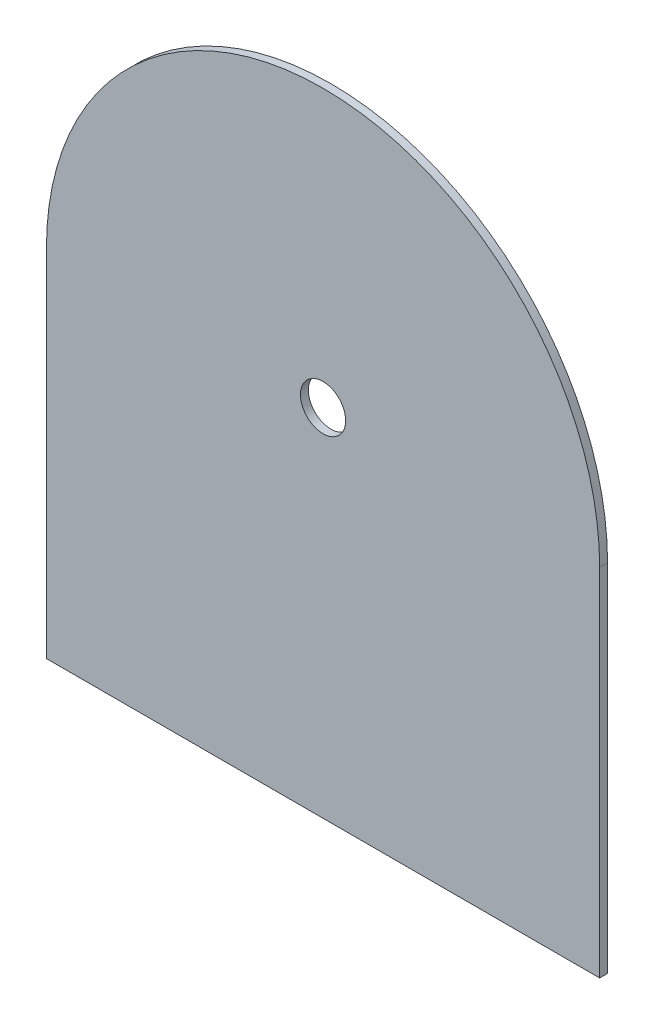
ISO-10303-21;
HEADER;
FILE_DESCRIPTION(('STEP AP214'),'2;1');
FILE_NAME('part.step','',(''),(''),'','','');
FILE_SCHEMA(('AUTOMOTIVE_DESIGN { 1 0 10303 214 1 1 1 1 }'));
ENDSEC;
DATA;
#1=APPLICATION_CONTEXT('core data for automotive mechanical design processes');
#2=APPLICATION_PROTOCOL_DEFINITION('international standard','automotive_design',2000,#1);
#3=PRODUCT_CONTEXT('',#1,'mechanical');
#4=PRODUCT('Part','Part','',(#3));
#5=PRODUCT_RELATED_PRODUCT_CATEGORY('part','',(#4));
#6=PRODUCT_DEFINITION_FORMATION('','',#4);
#7=PRODUCT_DEFINITION_CONTEXT('part definition',#1,'design');
#8=PRODUCT_DEFINITION('design','',#6,#7);
#9=PRODUCT_DEFINITION_SHAPE('','',#8);
#10=(LENGTH_UNIT() NAMED_UNIT(*) SI_UNIT(.MILLI.,.METRE.));
#11=(NAMED_UNIT(*) PLANE_ANGLE_UNIT() SI_UNIT($,.RADIAN.));
#12=(NAMED_UNIT(*) SI_UNIT($,.STERADIAN.) SOLID_ANGLE_UNIT());
#13=UNCERTAINTY_MEASURE_WITH_UNIT(LENGTH_MEASURE(1.E-05),#10,'distance_accuracy_value','');
#14=(GEOMETRIC_REPRESENTATION_CONTEXT(3) GLOBAL_UNCERTAINTY_ASSIGNED_CONTEXT((#13)) GLOBAL_UNIT_ASSIGNED_CONTEXT((#10,
#11,#12)) REPRESENTATION_CONTEXT('',''));
#15=CARTESIAN_POINT('',(0.,0.,0.));
#16=DIRECTION('',(0.,0.,1.));
#17=DIRECTION('',(1.,0.,0.));
#18=AXIS2_PLACEMENT_3D('',#15,#16,#17);
#19=CARTESIAN_POINT('',(-175.,0.,5.));
#20=DIRECTION('',(0.,1.,0.));
#21=DIRECTION('',(-1.,0.,0.));
#22=AXIS2_PLACEMENT_3D('',#19,#20,#21);
#23=PLANE('',#22);
#24=DIRECTION('',(1.,0.,0.));
#25=VECTOR('',#24,1.);
#26=CARTESIAN_POINT('',(-175.,0.,0.));
#27=LINE('',#26,#25);
#28=CARTESIAN_POINT('',(-175.,0.,0.));
#29=VERTEX_POINT('',#28);
#30=CARTESIAN_POINT('',(175.,0.,0.));
#31=VERTEX_POINT('',#30);
#32=EDGE_CURVE('E99',#29,#31,#27,.T.);
#33=ORIENTED_EDGE('',*,*,#32,.T.);
#34=DIRECTION('',(0.,0.,-1.));
#35=VECTOR('',#34,1.);
#36=CARTESIAN_POINT('',(175.,0.,5.));
#37=LINE('',#36,#35);
#38=CARTESIAN_POINT('',(175.,0.,5.));
#39=VERTEX_POINT('',#38);
#40=EDGE_CURVE('E11',#39,#31,#37,.T.);
#41=ORIENTED_EDGE('',*,*,#40,.F.);
#42=DIRECTION('',(1.,0.,0.));
#43=VECTOR('',#42,1.);
#44=CARTESIAN_POINT('',(-175.,0.,5.));
#45=LINE('',#44,#43);
#46=CARTESIAN_POINT('',(-175.,0.,5.));
#47=VERTEX_POINT('',#46);
#48=EDGE_CURVE('E86',#47,#39,#45,.T.);
#49=ORIENTED_EDGE('',*,*,#48,.F.);
#50=DIRECTION('',(0.,0.,-1.));
#51=VECTOR('',#50,1.);
#52=CARTESIAN_POINT('',(-175.,0.,5.));
#53=LINE('',#52,#51);
#54=EDGE_CURVE('E95',#47,#29,#53,.T.);
#55=ORIENTED_EDGE('',*,*,#54,.T.);
#56=EDGE_LOOP('',(#33,#41,#49,#55));
#57=FACE_BOUND('',#56,.T.);
#58=ADVANCED_FACE('F34',(#57),#23,.F.);
#59=CARTESIAN_POINT('',(175.,225.,5.));
#60=DIRECTION('',(-1.,0.,0.));
#61=DIRECTION('',(0.,-1.,0.));
#62=AXIS2_PLACEMENT_3D('',#59,#60,#61);
#63=PLANE('',#62);
#64=DIRECTION('',(0.,1.,0.));
#65=VECTOR('',#64,1.);
#66=CARTESIAN_POINT('',(175.,225.,0.));
#67=LINE('',#66,#65);
#68=CARTESIAN_POINT('',(175.,225.,0.));
#69=VERTEX_POINT('',#68);
#70=EDGE_CURVE('E90',#31,#69,#67,.T.);
#71=ORIENTED_EDGE('',*,*,#70,.T.);
#72=DIRECTION('',(0.,0.,-1.));
#73=VECTOR('',#72,1.);
#74=CARTESIAN_POINT('',(175.,225.,5.));
#75=LINE('',#74,#73);
#76=CARTESIAN_POINT('',(175.,225.,5.));
#77=VERTEX_POINT('',#76);
#78=EDGE_CURVE('E43',#77,#69,#75,.T.);
#79=ORIENTED_EDGE('',*,*,#78,.F.);
#80=DIRECTION('',(0.,1.,0.));
#81=VECTOR('',#80,1.);
#82=CARTESIAN_POINT('',(175.,225.,5.));
#83=LINE('',#82,#81);
#84=EDGE_CURVE('E81',#39,#77,#83,.T.);
#85=ORIENTED_EDGE('',*,*,#84,.F.);
#86=ORIENTED_EDGE('',*,*,#40,.T.);
#87=EDGE_LOOP('',(#71,#79,#85,#86));
#88=FACE_BOUND('',#87,.T.);
#89=ADVANCED_FACE('F89',(#88),#63,.F.);
#90=CARTESIAN_POINT('',(0.,225.,5.));
#91=DIRECTION('',(0.,0.,-1.));
#92=DIRECTION('',(-1.,0.,0.));
#93=AXIS2_PLACEMENT_3D('',#90,#91,#92);
#94=CYLINDRICAL_SURFACE('',#93,175.);
#95=CARTESIAN_POINT('',(0.,225.,0.));
#96=DIRECTION('',(0.,0.,1.));
#97=DIRECTION('',(-1.,0.,0.));
#98=AXIS2_PLACEMENT_3D('',#95,#96,#97);
#99=CIRCLE('',#98,175.);
#100=CARTESIAN_POINT('',(-175.,225.,0.));
#101=VERTEX_POINT('',#100);
#102=EDGE_CURVE('E68',#69,#101,#99,.T.);
#103=ORIENTED_EDGE('',*,*,#102,.T.);
#104=DIRECTION('',(0.,0.,-1.));
#105=VECTOR('',#104,1.);
#106=CARTESIAN_POINT('',(-175.,225.,5.));
#107=LINE('',#106,#105);
#108=CARTESIAN_POINT('',(-175.,225.,5.));
#109=VERTEX_POINT('',#108);
#110=EDGE_CURVE('E91',#109,#101,#107,.T.);
#111=ORIENTED_EDGE('',*,*,#110,.F.);
#112=CARTESIAN_POINT('',(0.,225.,5.));
#113=DIRECTION('',(0.,0.,1.));
#114=DIRECTION('',(-1.,0.,0.));
#115=AXIS2_PLACEMENT_3D('',#112,#113,#114);
#116=CIRCLE('',#115,175.);
#117=EDGE_CURVE('E84',#77,#109,#116,.T.);
#118=ORIENTED_EDGE('',*,*,#117,.F.);
#119=ORIENTED_EDGE('',*,*,#78,.T.);
#120=EDGE_LOOP('',(#103,#111,#118,#119));
#121=FACE_BOUND('',#120,.T.);
#122=ADVANCED_FACE('F93',(#121),#94,.T.);
#123=CARTESIAN_POINT('',(-175.,225.,5.));
#124=DIRECTION('',(1.,0.,0.));
#125=DIRECTION('',(0.,1.,0.));
#126=AXIS2_PLACEMENT_3D('',#123,#124,#125);
#127=PLANE('',#126);
#128=DIRECTION('',(0.,-1.,0.));
#129=VECTOR('',#128,1.);
#130=CARTESIAN_POINT('',(-175.,225.,0.));
#131=LINE('',#130,#129);
#132=EDGE_CURVE('E74',#101,#29,#131,.T.);
#133=ORIENTED_EDGE('',*,*,#132,.T.);
#134=ORIENTED_EDGE('',*,*,#54,.F.);
#135=DIRECTION('',(0.,-1.,0.));
#136=VECTOR('',#135,1.);
#137=CARTESIAN_POINT('',(-175.,225.,5.));
#138=LINE('',#137,#136);
#139=EDGE_CURVE('E51',#109,#47,#138,.T.);
#140=ORIENTED_EDGE('',*,*,#139,.F.);
#141=ORIENTED_EDGE('',*,*,#110,.T.);
#142=EDGE_LOOP('',(#133,#134,#140,#141));
#143=FACE_BOUND('',#142,.T.);
#144=ADVANCED_FACE('F106',(#143),#127,.F.);
#145=CARTESIAN_POINT('',(0.,225.,5.));
#146=DIRECTION('',(0.,0.,-1.));
#147=DIRECTION('',(-1.,0.,0.));
#148=AXIS2_PLACEMENT_3D('',#145,#146,#147);
#149=PLANE('',#148);
#150=CARTESIAN_POINT('',(0.,225.,5.));
#151=DIRECTION('',(0.,0.,1.));
#152=DIRECTION('',(1.,0.,0.));
#153=AXIS2_PLACEMENT_3D('',#150,#151,#152);
#154=CIRCLE('',#153,14.3);
#155=CARTESIAN_POINT('',(14.3,225.,5.));
#156=VERTEX_POINT('',#155);
#157=EDGE_CURVE('E112',#156,#156,#154,.T.);
#158=ORIENTED_EDGE('',*,*,#157,.F.);
#159=EDGE_LOOP('',(#158));
#160=FACE_BOUND('',#159,.T.);
#161=ORIENTED_EDGE('',*,*,#48,.T.);
#162=ORIENTED_EDGE('',*,*,#84,.T.);
#163=ORIENTED_EDGE('',*,*,#117,.T.);
#164=ORIENTED_EDGE('',*,*,#139,.T.);
#165=EDGE_LOOP('',(#161,#162,#163,#164));
#166=FACE_BOUND('',#165,.T.);
#167=ADVANCED_FACE('F82',(#160,#166),#149,.F.);
#168=CARTESIAN_POINT('',(0.,225.,0.));
#169=DIRECTION('',(0.,0.,-1.));
#170=DIRECTION('',(-1.,0.,0.));
#171=AXIS2_PLACEMENT_3D('',#168,#169,#170);
#172=PLANE('',#171);
#173=CARTESIAN_POINT('',(0.,225.,0.));
#174=DIRECTION('',(0.,0.,-1.));
#175=DIRECTION('',(-1.,0.,0.));
#176=AXIS2_PLACEMENT_3D('',#173,#174,#175);
#177=CIRCLE('',#176,14.3);
#178=CARTESIAN_POINT('',(-14.3,225.,0.));
#179=VERTEX_POINT('',#178);
#180=EDGE_CURVE('E37',#179,#179,#177,.T.);
#181=ORIENTED_EDGE('',*,*,#180,.F.);
#182=EDGE_LOOP('',(#181));
#183=FACE_BOUND('',#182,.T.);
#184=ORIENTED_EDGE('',*,*,#32,.F.);
#185=ORIENTED_EDGE('',*,*,#132,.F.);
#186=ORIENTED_EDGE('',*,*,#102,.F.);
#187=ORIENTED_EDGE('',*,*,#70,.F.);
#188=EDGE_LOOP('',(#184,#185,#186,#187));
#189=FACE_BOUND('',#188,.T.);
#190=ADVANCED_FACE('F109',(#183,#189),#172,.T.);
#191=CARTESIAN_POINT('',(0.,225.,-5.));
#192=DIRECTION('',(0.,0.,1.));
#193=DIRECTION('',(1.,0.,0.));
#194=AXIS2_PLACEMENT_3D('',#191,#192,#193);
#195=CYLINDRICAL_SURFACE('',#194,14.3);
#196=ORIENTED_EDGE('',*,*,#180,.T.);
#197=EDGE_LOOP('',(#196));
#198=FACE_BOUND('',#197,.T.);
#199=ORIENTED_EDGE('',*,*,#157,.T.);
#200=EDGE_LOOP('',(#199));
#201=FACE_BOUND('',#200,.T.);
#202=ADVANCED_FACE('F119',(#198,#201),#195,.F.);
#203=CLOSED_SHELL('',(#58,#89,#122,#144,#167,#190,#202));
#204=MANIFOLD_SOLID_BREP('B2',#203);
#205=ADVANCED_BREP_SHAPE_REPRESENTATION('',(#18,#204),#14);
#206=SHAPE_DEFINITION_REPRESENTATION(#9,#205);
ENDSEC;
END-ISO-10303-21;
